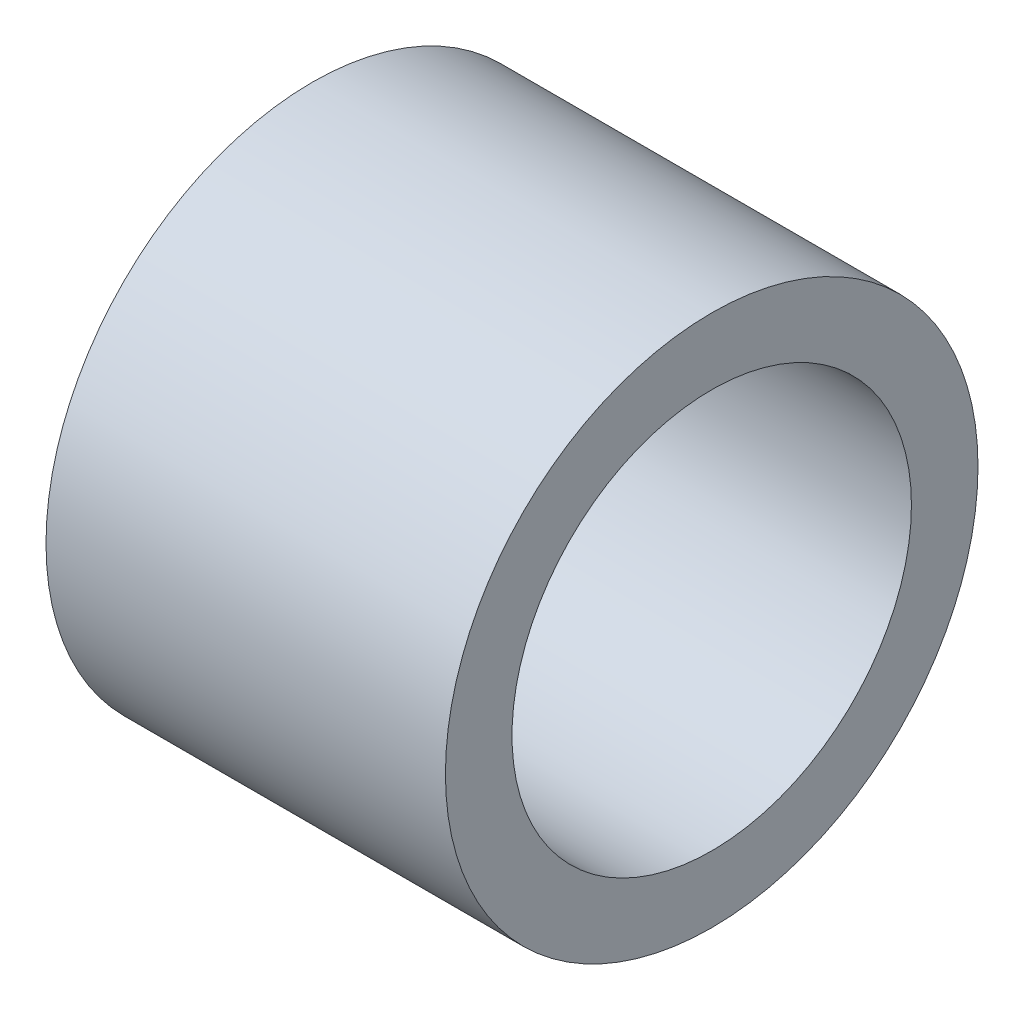
ISO-10303-21;
HEADER;
FILE_DESCRIPTION(('STEP AP214'),'2;1');
FILE_NAME('part.step','',(''),(''),'','','');
FILE_SCHEMA(('AUTOMOTIVE_DESIGN { 1 0 10303 214 1 1 1 1 }'));
ENDSEC;
DATA;
#1=APPLICATION_CONTEXT('core data for automotive mechanical design processes');
#2=APPLICATION_PROTOCOL_DEFINITION('international standard','automotive_design',2000,#1);
#3=PRODUCT_CONTEXT('',#1,'mechanical');
#4=PRODUCT('Part','Part','',(#3));
#5=PRODUCT_RELATED_PRODUCT_CATEGORY('part','',(#4));
#6=PRODUCT_DEFINITION_FORMATION('','',#4);
#7=PRODUCT_DEFINITION_CONTEXT('part definition',#1,'design');
#8=PRODUCT_DEFINITION('design','',#6,#7);
#9=PRODUCT_DEFINITION_SHAPE('','',#8);
#10=(LENGTH_UNIT() NAMED_UNIT(*) SI_UNIT(.MILLI.,.METRE.));
#11=(NAMED_UNIT(*) PLANE_ANGLE_UNIT() SI_UNIT($,.RADIAN.));
#12=(NAMED_UNIT(*) SI_UNIT($,.STERADIAN.) SOLID_ANGLE_UNIT());
#13=UNCERTAINTY_MEASURE_WITH_UNIT(LENGTH_MEASURE(1.E-05),#10,'distance_accuracy_value','');
#14=(GEOMETRIC_REPRESENTATION_CONTEXT(3) GLOBAL_UNCERTAINTY_ASSIGNED_CONTEXT((#13)) GLOBAL_UNIT_ASSIGNED_CONTEXT((#10,
#11,#12)) REPRESENTATION_CONTEXT('',''));
#15=CARTESIAN_POINT('',(0.,0.,0.));
#16=DIRECTION('',(0.,0.,1.));
#17=DIRECTION('',(1.,0.,0.));
#18=AXIS2_PLACEMENT_3D('',#15,#16,#17);
#19=CARTESIAN_POINT('',(9.525,0.,0.));
#20=DIRECTION('',(1.,0.,0.));
#21=DIRECTION('',(0.,0.,-1.));
#22=AXIS2_PLACEMENT_3D('',#19,#20,#21);
#23=PLANE('',#22);
#24=CARTESIAN_POINT('',(9.525,0.,0.));
#25=DIRECTION('',(1.,0.,0.));
#26=DIRECTION('',(0.,0.,-1.));
#27=AXIS2_PLACEMENT_3D('',#24,#25,#26);
#28=CIRCLE('',#27,12.7);
#29=CARTESIAN_POINT('',(9.525,0.,-12.7));
#30=VERTEX_POINT('',#29);
#31=EDGE_CURVE('E10',#30,#30,#28,.T.);
#32=ORIENTED_EDGE('',*,*,#31,.T.);
#33=EDGE_LOOP('',(#32));
#34=FACE_BOUND('',#33,.T.);
#35=CARTESIAN_POINT('',(9.525,0.,0.));
#36=DIRECTION('',(1.,0.,0.));
#37=DIRECTION('',(0.,0.,-1.));
#38=AXIS2_PLACEMENT_3D('',#35,#36,#37);
#39=CIRCLE('',#38,9.525);
#40=CARTESIAN_POINT('',(9.525,0.,-9.525));
#41=VERTEX_POINT('',#40);
#42=EDGE_CURVE('E50',#41,#41,#39,.T.);
#43=ORIENTED_EDGE('',*,*,#42,.F.);
#44=EDGE_LOOP('',(#43));
#45=FACE_BOUND('',#44,.T.);
#46=ADVANCED_FACE('F37',(#34,#45),#23,.T.);
#47=CARTESIAN_POINT('',(-9.525,0.,0.));
#48=DIRECTION('',(1.,0.,0.));
#49=DIRECTION('',(0.,0.,-1.));
#50=AXIS2_PLACEMENT_3D('',#47,#48,#49);
#51=PLANE('',#50);
#52=CARTESIAN_POINT('',(-9.525,0.,0.));
#53=DIRECTION('',(1.,0.,0.));
#54=DIRECTION('',(0.,0.,-1.));
#55=AXIS2_PLACEMENT_3D('',#52,#53,#54);
#56=CIRCLE('',#55,12.7);
#57=CARTESIAN_POINT('',(-9.525,0.,-12.7));
#58=VERTEX_POINT('',#57);
#59=EDGE_CURVE('E41',#58,#58,#56,.T.);
#60=ORIENTED_EDGE('',*,*,#59,.F.);
#61=EDGE_LOOP('',(#60));
#62=FACE_BOUND('',#61,.T.);
#63=CARTESIAN_POINT('',(-9.525,0.,0.));
#64=DIRECTION('',(1.,0.,0.));
#65=DIRECTION('',(0.,0.,-1.));
#66=AXIS2_PLACEMENT_3D('',#63,#64,#65);
#67=CIRCLE('',#66,9.525);
#68=CARTESIAN_POINT('',(-9.525,0.,-9.525));
#69=VERTEX_POINT('',#68);
#70=EDGE_CURVE('E52',#69,#69,#67,.T.);
#71=ORIENTED_EDGE('',*,*,#70,.T.);
#72=EDGE_LOOP('',(#71));
#73=FACE_BOUND('',#72,.T.);
#74=ADVANCED_FACE('F64',(#62,#73),#51,.F.);
#75=CARTESIAN_POINT('',(9.525,0.,0.));
#76=DIRECTION('',(-1.,0.,0.));
#77=DIRECTION('',(0.,0.,1.));
#78=AXIS2_PLACEMENT_3D('',#75,#76,#77);
#79=CYLINDRICAL_SURFACE('',#78,12.7);
#80=ORIENTED_EDGE('',*,*,#31,.F.);
#81=EDGE_LOOP('',(#80));
#82=FACE_BOUND('',#81,.T.);
#83=ORIENTED_EDGE('',*,*,#59,.T.);
#84=EDGE_LOOP('',(#83));
#85=FACE_BOUND('',#84,.T.);
#86=ADVANCED_FACE('F39',(#82,#85),#79,.T.);
#87=CARTESIAN_POINT('',(9.525,0.,0.));
#88=DIRECTION('',(-1.,0.,0.));
#89=DIRECTION('',(0.,0.,1.));
#90=AXIS2_PLACEMENT_3D('',#87,#88,#89);
#91=CYLINDRICAL_SURFACE('',#90,9.525);
#92=ORIENTED_EDGE('',*,*,#42,.T.);
#93=EDGE_LOOP('',(#92));
#94=FACE_BOUND('',#93,.T.);
#95=ORIENTED_EDGE('',*,*,#70,.F.);
#96=EDGE_LOOP('',(#95));
#97=FACE_BOUND('',#96,.T.);
#98=ADVANCED_FACE('F60',(#94,#97),#91,.F.);
#99=CLOSED_SHELL('',(#46,#74,#86,#98));
#100=MANIFOLD_SOLID_BREP('B2',#99);
#101=ADVANCED_BREP_SHAPE_REPRESENTATION('',(#18,#100),#14);
#102=SHAPE_DEFINITION_REPRESENTATION(#9,#101);
ENDSEC;
END-ISO-10303-21;
